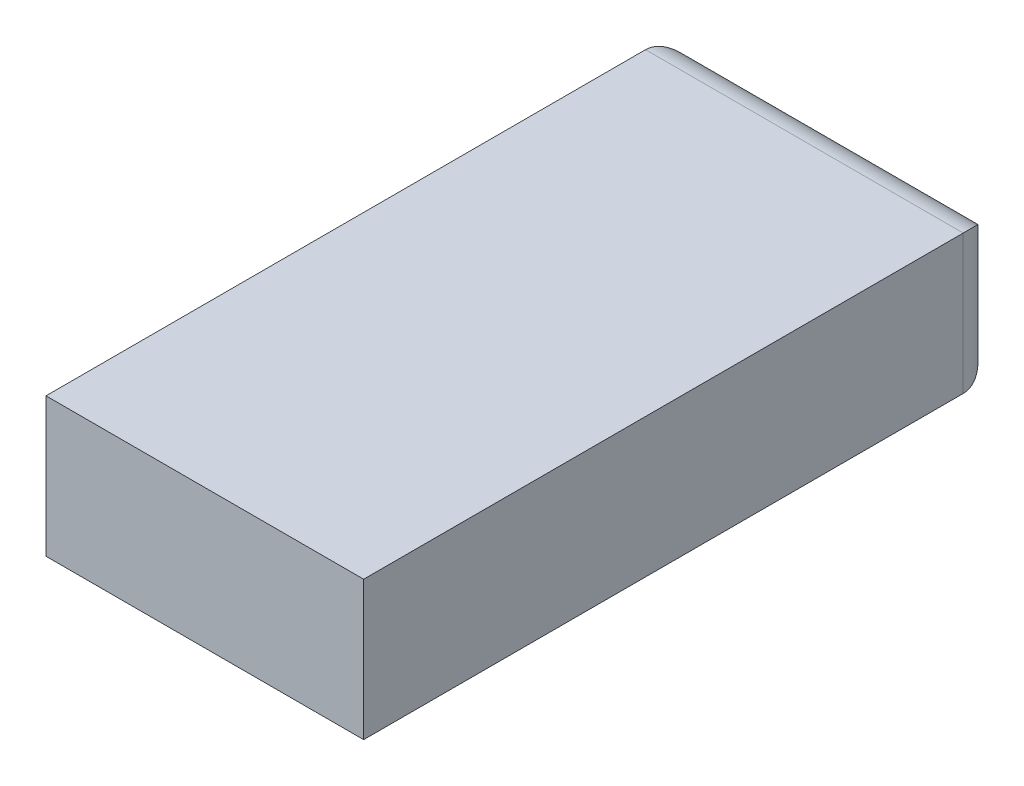
ISO-10303-21;
HEADER;
FILE_DESCRIPTION(('STEP AP214'),'2;1');
FILE_NAME('part.step','',(''),(''),'','','');
FILE_SCHEMA(('AUTOMOTIVE_DESIGN { 1 0 10303 214 1 1 1 1 }'));
ENDSEC;
DATA;
#1=APPLICATION_CONTEXT('core data for automotive mechanical design processes');
#2=APPLICATION_PROTOCOL_DEFINITION('international standard','automotive_design',2000,#1);
#3=PRODUCT_CONTEXT('',#1,'mechanical');
#4=PRODUCT('Part','Part','',(#3));
#5=PRODUCT_RELATED_PRODUCT_CATEGORY('part','',(#4));
#6=PRODUCT_DEFINITION_FORMATION('','',#4);
#7=PRODUCT_DEFINITION_CONTEXT('part definition',#1,'design');
#8=PRODUCT_DEFINITION('design','',#6,#7);
#9=PRODUCT_DEFINITION_SHAPE('','',#8);
#10=(LENGTH_UNIT() NAMED_UNIT(*) SI_UNIT(.MILLI.,.METRE.));
#11=(NAMED_UNIT(*) PLANE_ANGLE_UNIT() SI_UNIT($,.RADIAN.));
#12=(NAMED_UNIT(*) SI_UNIT($,.STERADIAN.) SOLID_ANGLE_UNIT());
#13=UNCERTAINTY_MEASURE_WITH_UNIT(LENGTH_MEASURE(1.E-05),#10,'distance_accuracy_value','');
#14=(GEOMETRIC_REPRESENTATION_CONTEXT(3) GLOBAL_UNCERTAINTY_ASSIGNED_CONTEXT((#13)) GLOBAL_UNIT_ASSIGNED_CONTEXT((#10,
#11,#12)) REPRESENTATION_CONTEXT('',''));
#15=CARTESIAN_POINT('',(0.,0.,0.));
#16=DIRECTION('',(0.,0.,1.));
#17=DIRECTION('',(1.,0.,0.));
#18=AXIS2_PLACEMENT_3D('',#15,#16,#17);
#19=CARTESIAN_POINT('',(50.8,44.45,101.6));
#20=DIRECTION('',(-1.,0.,0.));
#21=DIRECTION('',(0.,0.,1.));
#22=AXIS2_PLACEMENT_3D('',#19,#20,#21);
#23=PLANE('',#22);
#24=DIRECTION('',(0.,0.,-1.));
#25=VECTOR('',#24,1.);
#26=CARTESIAN_POINT('',(50.8,0.,101.6));
#27=LINE('',#26,#25);
#28=CARTESIAN_POINT('',(50.8,0.,101.6));
#29=VERTEX_POINT('',#28);
#30=CARTESIAN_POINT('',(50.8,0.,-90.17));
#31=VERTEX_POINT('',#30);
#32=EDGE_CURVE('E121',#29,#31,#27,.T.);
#33=ORIENTED_EDGE('',*,*,#32,.T.);
#34=DIRECTION('',(0.,-1.,0.));
#35=VECTOR('',#34,1.);
#36=CARTESIAN_POINT('',(50.8,44.45,-90.17));
#37=LINE('',#36,#35);
#38=CARTESIAN_POINT('',(50.8,44.45,-90.17));
#39=VERTEX_POINT('',#38);
#40=EDGE_CURVE('E142',#31,#39,#37,.F.);
#41=ORIENTED_EDGE('',*,*,#40,.T.);
#42=DIRECTION('',(0.,0.,-1.));
#43=VECTOR('',#42,1.);
#44=CARTESIAN_POINT('',(50.8,44.45,101.6));
#45=LINE('',#44,#43);
#46=CARTESIAN_POINT('',(50.8,44.45,101.6));
#47=VERTEX_POINT('',#46);
#48=EDGE_CURVE('E99',#47,#39,#45,.T.);
#49=ORIENTED_EDGE('',*,*,#48,.F.);
#50=DIRECTION('',(0.,-1.,0.));
#51=VECTOR('',#50,1.);
#52=CARTESIAN_POINT('',(50.8,44.45,101.6));
#53=LINE('',#52,#51);
#54=EDGE_CURVE('E109',#47,#29,#53,.T.);
#55=ORIENTED_EDGE('',*,*,#54,.T.);
#56=EDGE_LOOP('',(#33,#41,#49,#55));
#57=FACE_BOUND('',#56,.T.);
#58=ADVANCED_FACE('F40',(#57),#23,.F.);
#59=CARTESIAN_POINT('',(-50.8,44.45,-101.6));
#60=DIRECTION('',(0.,0.,1.));
#61=DIRECTION('',(1.,0.,0.));
#62=AXIS2_PLACEMENT_3D('',#59,#60,#61);
#63=PLANE('',#62);
#64=DIRECTION('',(-1.,0.,0.));
#65=VECTOR('',#64,1.);
#66=CARTESIAN_POINT('',(-50.8,33.02,-101.6));
#67=LINE('',#66,#65);
#68=CARTESIAN_POINT('',(-39.37,33.02,-101.6));
#69=VERTEX_POINT('',#68);
#70=CARTESIAN_POINT('',(39.37,33.02,-101.6));
#71=VERTEX_POINT('',#70);
#72=EDGE_CURVE('E135',#69,#71,#67,.F.);
#73=ORIENTED_EDGE('',*,*,#72,.T.);
#74=DIRECTION('',(0.,-1.,0.));
#75=VECTOR('',#74,1.);
#76=CARTESIAN_POINT('',(39.37,44.45,-101.6));
#77=LINE('',#76,#75);
#78=CARTESIAN_POINT('',(39.37,11.43,-101.6));
#79=VERTEX_POINT('',#78);
#80=EDGE_CURVE('E138',#71,#79,#77,.T.);
#81=ORIENTED_EDGE('',*,*,#80,.T.);
#82=DIRECTION('',(-1.,0.,0.));
#83=VECTOR('',#82,1.);
#84=CARTESIAN_POINT('',(-50.8,11.43,-101.6));
#85=LINE('',#84,#83);
#86=CARTESIAN_POINT('',(-39.37,11.43,-101.6));
#87=VERTEX_POINT('',#86);
#88=EDGE_CURVE('E108',#79,#87,#85,.T.);
#89=ORIENTED_EDGE('',*,*,#88,.T.);
#90=DIRECTION('',(0.,-1.,0.));
#91=VECTOR('',#90,1.);
#92=CARTESIAN_POINT('',(-39.37,44.45,-101.6));
#93=LINE('',#92,#91);
#94=EDGE_CURVE('E132',#87,#69,#93,.F.);
#95=ORIENTED_EDGE('',*,*,#94,.T.);
#96=EDGE_LOOP('',(#73,#81,#89,#95));
#97=FACE_BOUND('',#96,.T.);
#98=ADVANCED_FACE('F184',(#97),#63,.F.);
#99=CARTESIAN_POINT('',(-50.8,44.45,101.6));
#100=DIRECTION('',(1.,0.,0.));
#101=DIRECTION('',(0.,0.,-1.));
#102=AXIS2_PLACEMENT_3D('',#99,#100,#101);
#103=PLANE('',#102);
#104=DIRECTION('',(0.,0.,1.));
#105=VECTOR('',#104,1.);
#106=CARTESIAN_POINT('',(-50.8,44.45,101.6));
#107=LINE('',#106,#105);
#108=CARTESIAN_POINT('',(-50.8,44.45,-90.17));
#109=VERTEX_POINT('',#108);
#110=CARTESIAN_POINT('',(-50.8,44.45,101.6));
#111=VERTEX_POINT('',#110);
#112=EDGE_CURVE('E92',#109,#111,#107,.T.);
#113=ORIENTED_EDGE('',*,*,#112,.F.);
#114=DIRECTION('',(0.,-1.,0.));
#115=VECTOR('',#114,1.);
#116=CARTESIAN_POINT('',(-50.8,44.45,-90.17));
#117=LINE('',#116,#115);
#118=CARTESIAN_POINT('',(-50.8,0.,-90.17));
#119=VERTEX_POINT('',#118);
#120=EDGE_CURVE('E50',#109,#119,#117,.T.);
#121=ORIENTED_EDGE('',*,*,#120,.T.);
#122=DIRECTION('',(0.,0.,1.));
#123=VECTOR('',#122,1.);
#124=CARTESIAN_POINT('',(-50.8,0.,101.6));
#125=LINE('',#124,#123);
#126=CARTESIAN_POINT('',(-50.8,0.,101.6));
#127=VERTEX_POINT('',#126);
#128=EDGE_CURVE('E104',#119,#127,#125,.T.);
#129=ORIENTED_EDGE('',*,*,#128,.T.);
#130=DIRECTION('',(0.,-1.,0.));
#131=VECTOR('',#130,1.);
#132=CARTESIAN_POINT('',(-50.8,44.45,101.6));
#133=LINE('',#132,#131);
#134=EDGE_CURVE('E102',#111,#127,#133,.T.);
#135=ORIENTED_EDGE('',*,*,#134,.F.);
#136=EDGE_LOOP('',(#113,#121,#129,#135));
#137=FACE_BOUND('',#136,.T.);
#138=ADVANCED_FACE('F103',(#137),#103,.F.);
#139=CARTESIAN_POINT('',(-50.8,44.45,101.6));
#140=DIRECTION('',(0.,0.,-1.));
#141=DIRECTION('',(-1.,0.,0.));
#142=AXIS2_PLACEMENT_3D('',#139,#140,#141);
#143=PLANE('',#142);
#144=DIRECTION('',(1.,0.,0.));
#145=VECTOR('',#144,1.);
#146=CARTESIAN_POINT('',(-50.8,0.,101.6));
#147=LINE('',#146,#145);
#148=EDGE_CURVE('E127',#127,#29,#147,.T.);
#149=ORIENTED_EDGE('',*,*,#148,.T.);
#150=ORIENTED_EDGE('',*,*,#54,.F.);
#151=DIRECTION('',(1.,0.,0.));
#152=VECTOR('',#151,1.);
#153=CARTESIAN_POINT('',(-50.8,44.45,101.6));
#154=LINE('',#153,#152);
#155=EDGE_CURVE('E96',#111,#47,#154,.T.);
#156=ORIENTED_EDGE('',*,*,#155,.F.);
#157=ORIENTED_EDGE('',*,*,#134,.T.);
#158=EDGE_LOOP('',(#149,#150,#156,#157));
#159=FACE_BOUND('',#158,.T.);
#160=ADVANCED_FACE('F111',(#159),#143,.F.);
#161=CARTESIAN_POINT('',(0.,44.45,0.));
#162=DIRECTION('',(0.,-1.,0.));
#163=DIRECTION('',(0.,0.,-1.));
#164=AXIS2_PLACEMENT_3D('',#161,#162,#163);
#165=PLANE('',#164);
#166=ORIENTED_EDGE('',*,*,#48,.T.);
#167=DIRECTION('',(-1.,0.,0.));
#168=VECTOR('',#167,1.);
#169=CARTESIAN_POINT('',(0.,44.45,-90.17));
#170=LINE('',#169,#168);
#171=EDGE_CURVE('E65',#39,#109,#170,.T.);
#172=ORIENTED_EDGE('',*,*,#171,.T.);
#173=ORIENTED_EDGE('',*,*,#112,.T.);
#174=ORIENTED_EDGE('',*,*,#155,.T.);
#175=EDGE_LOOP('',(#166,#172,#173,#174));
#176=FACE_BOUND('',#175,.T.);
#177=ADVANCED_FACE('F94',(#176),#165,.F.);
#178=CARTESIAN_POINT('',(0.,0.,0.));
#179=DIRECTION('',(0.,-1.,0.));
#180=DIRECTION('',(0.,0.,-1.));
#181=AXIS2_PLACEMENT_3D('',#178,#179,#180);
#182=PLANE('',#181);
#183=ORIENTED_EDGE('',*,*,#128,.F.);
#184=DIRECTION('',(-1.,0.,0.));
#185=VECTOR('',#184,1.);
#186=CARTESIAN_POINT('',(50.8,0.,-90.17));
#187=LINE('',#186,#185);
#188=EDGE_CURVE('E11',#119,#31,#187,.F.);
#189=ORIENTED_EDGE('',*,*,#188,.T.);
#190=ORIENTED_EDGE('',*,*,#32,.F.);
#191=ORIENTED_EDGE('',*,*,#148,.F.);
#192=EDGE_LOOP('',(#183,#189,#190,#191));
#193=FACE_BOUND('',#192,.T.);
#194=ADVANCED_FACE('F177',(#193),#182,.T.);
#195=CARTESIAN_POINT('',(-39.37,44.45,-90.17));
#196=DIRECTION('',(0.,-1.,0.));
#197=DIRECTION('',(0.,0.,-1.));
#198=AXIS2_PLACEMENT_3D('',#195,#196,#197);
#199=CYLINDRICAL_SURFACE('',#198,11.43);
#200=CARTESIAN_POINT('',(-39.37,11.43,-90.17));
#201=DIRECTION('',(0.707106781186547,-0.707106781186547,0.));
#202=DIRECTION('',(0.707106781186547,0.707106781186547,0.));
#203=AXIS2_PLACEMENT_3D('',#200,#201,#202);
#204=ELLIPSE('',#203,16.1644610179245,11.43);
#205=EDGE_CURVE('E155',#119,#87,#204,.T.);
#206=ORIENTED_EDGE('',*,*,#205,.F.);
#207=ORIENTED_EDGE('',*,*,#120,.F.);
#208=CARTESIAN_POINT('',(-39.37,33.02,-90.17));
#209=DIRECTION('',(-0.707106781186547,-0.707106781186547,0.));
#210=DIRECTION('',(0.707106781186547,-0.707106781186547,0.));
#211=AXIS2_PLACEMENT_3D('',#208,#209,#210);
#212=ELLIPSE('',#211,16.1644610179245,11.43);
#213=EDGE_CURVE('E44',#69,#109,#212,.F.);
#214=ORIENTED_EDGE('',*,*,#213,.F.);
#215=ORIENTED_EDGE('',*,*,#94,.F.);
#216=EDGE_LOOP('',(#206,#207,#214,#215));
#217=FACE_BOUND('',#216,.T.);
#218=ADVANCED_FACE('F42',(#217),#199,.T.);
#219=CARTESIAN_POINT('',(0.,33.02,-90.17));
#220=DIRECTION('',(-1.,0.,0.));
#221=DIRECTION('',(0.,0.,1.));
#222=AXIS2_PLACEMENT_3D('',#219,#220,#221);
#223=CYLINDRICAL_SURFACE('',#222,11.43);
#224=ORIENTED_EDGE('',*,*,#213,.T.);
#225=ORIENTED_EDGE('',*,*,#171,.F.);
#226=CARTESIAN_POINT('',(39.37,33.02,-90.17));
#227=DIRECTION('',(-0.707106781186547,0.707106781186547,0.));
#228=DIRECTION('',(-0.707106781186547,-0.707106781186547,0.));
#229=AXIS2_PLACEMENT_3D('',#226,#227,#228);
#230=ELLIPSE('',#229,16.1644610179245,11.43);
#231=EDGE_CURVE('E153',#71,#39,#230,.F.);
#232=ORIENTED_EDGE('',*,*,#231,.F.);
#233=ORIENTED_EDGE('',*,*,#72,.F.);
#234=EDGE_LOOP('',(#224,#225,#232,#233));
#235=FACE_BOUND('',#234,.T.);
#236=ADVANCED_FACE('F169',(#235),#223,.T.);
#237=CARTESIAN_POINT('',(-50.8,11.43,-90.17));
#238=DIRECTION('',(1.,0.,0.));
#239=DIRECTION('',(0.,0.,-1.));
#240=AXIS2_PLACEMENT_3D('',#237,#238,#239);
#241=CYLINDRICAL_SURFACE('',#240,11.43);
#242=ORIENTED_EDGE('',*,*,#205,.T.);
#243=ORIENTED_EDGE('',*,*,#88,.F.);
#244=CARTESIAN_POINT('',(39.37,11.43,-90.17));
#245=DIRECTION('',(0.707106781186547,0.707106781186547,0.));
#246=DIRECTION('',(0.707106781186547,-0.707106781186547,0.));
#247=AXIS2_PLACEMENT_3D('',#244,#245,#246);
#248=ELLIPSE('',#247,16.1644610179245,11.43);
#249=EDGE_CURVE('E150',#31,#79,#248,.T.);
#250=ORIENTED_EDGE('',*,*,#249,.F.);
#251=ORIENTED_EDGE('',*,*,#188,.F.);
#252=EDGE_LOOP('',(#242,#243,#250,#251));
#253=FACE_BOUND('',#252,.T.);
#254=ADVANCED_FACE('F174',(#253),#241,.T.);
#255=CARTESIAN_POINT('',(39.37,44.45,-90.17));
#256=DIRECTION('',(0.,-1.,0.));
#257=DIRECTION('',(0.,0.,-1.));
#258=AXIS2_PLACEMENT_3D('',#255,#256,#257);
#259=CYLINDRICAL_SURFACE('',#258,11.43);
#260=ORIENTED_EDGE('',*,*,#231,.T.);
#261=ORIENTED_EDGE('',*,*,#40,.F.);
#262=ORIENTED_EDGE('',*,*,#249,.T.);
#263=ORIENTED_EDGE('',*,*,#80,.F.);
#264=EDGE_LOOP('',(#260,#261,#262,#263));
#265=FACE_BOUND('',#264,.T.);
#266=ADVANCED_FACE('F181',(#265),#259,.T.);
#267=CLOSED_SHELL('',(#58,#98,#138,#160,#177,#194,#218,#236,#254,#266));
#268=MANIFOLD_SOLID_BREP('B2',#267);
#269=ADVANCED_BREP_SHAPE_REPRESENTATION('',(#18,#268),#14);
#270=SHAPE_DEFINITION_REPRESENTATION(#9,#269);
ENDSEC;
END-ISO-10303-21;
